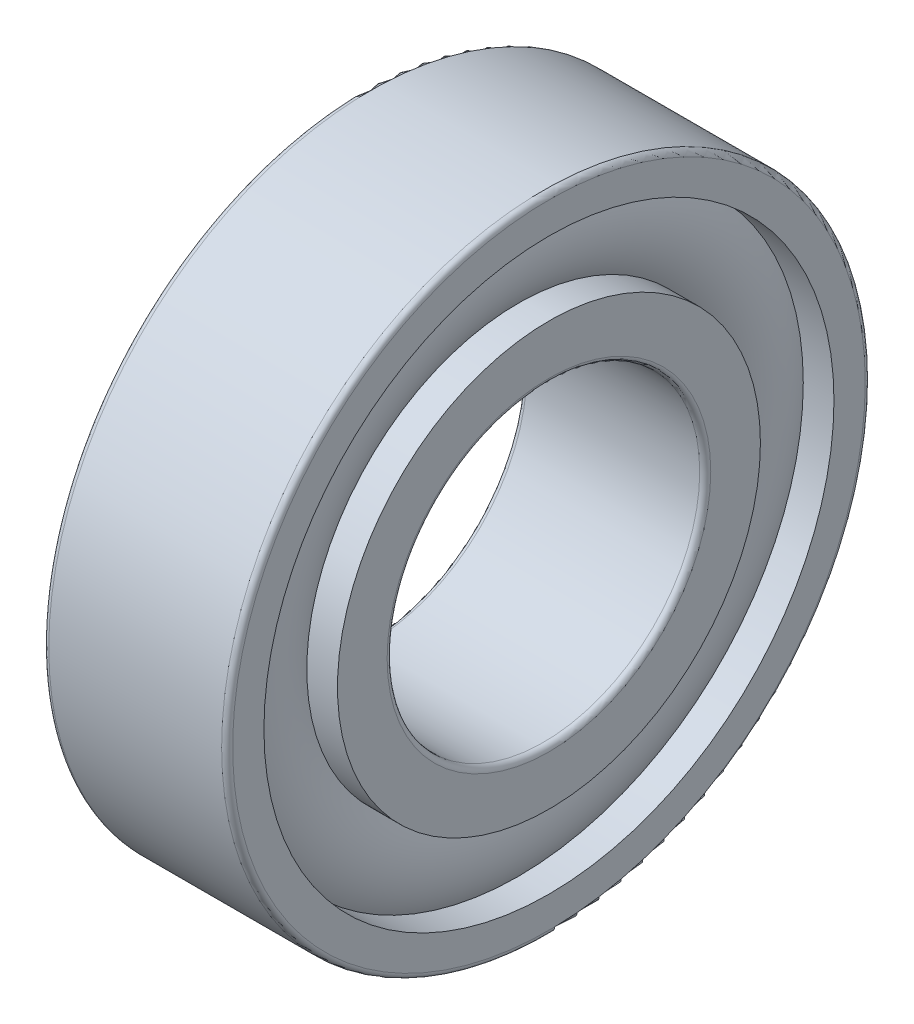
ISO-10303-21;
HEADER;
FILE_DESCRIPTION(('STEP AP214'),'2;1');
FILE_NAME('part.step','',(''),(''),'','','');
FILE_SCHEMA(('AUTOMOTIVE_DESIGN { 1 0 10303 214 1 1 1 1 }'));
ENDSEC;
DATA;
#1=APPLICATION_CONTEXT('core data for automotive mechanical design processes');
#2=APPLICATION_PROTOCOL_DEFINITION('international standard','automotive_design',2000,#1);
#3=PRODUCT_CONTEXT('',#1,'mechanical');
#4=PRODUCT('Part','Part','',(#3));
#5=PRODUCT_RELATED_PRODUCT_CATEGORY('part','',(#4));
#6=PRODUCT_DEFINITION_FORMATION('','',#4);
#7=PRODUCT_DEFINITION_CONTEXT('part definition',#1,'design');
#8=PRODUCT_DEFINITION('design','',#6,#7);
#9=PRODUCT_DEFINITION_SHAPE('','',#8);
#10=(LENGTH_UNIT() NAMED_UNIT(*) SI_UNIT(.MILLI.,.METRE.));
#11=(NAMED_UNIT(*) PLANE_ANGLE_UNIT() SI_UNIT($,.RADIAN.));
#12=(NAMED_UNIT(*) SI_UNIT($,.STERADIAN.) SOLID_ANGLE_UNIT());
#13=UNCERTAINTY_MEASURE_WITH_UNIT(LENGTH_MEASURE(1.E-05),#10,'distance_accuracy_value','');
#14=(GEOMETRIC_REPRESENTATION_CONTEXT(3) GLOBAL_UNCERTAINTY_ASSIGNED_CONTEXT((#13)) GLOBAL_UNIT_ASSIGNED_CONTEXT((#10,
#11,#12)) REPRESENTATION_CONTEXT('',''));
#15=CARTESIAN_POINT('',(0.,0.,0.));
#16=DIRECTION('',(0.,0.,1.));
#17=DIRECTION('',(1.,0.,0.));
#18=AXIS2_PLACEMENT_3D('',#15,#16,#17);
#19=CARTESIAN_POINT('',(14.7,0.,0.));
#20=DIRECTION('',(1.,0.,0.));
#21=DIRECTION('',(0.,0.,-1.));
#22=AXIS2_PLACEMENT_3D('',#19,#20,#21);
#23=CYLINDRICAL_SURFACE('',#22,11.5);
#24=CARTESIAN_POINT('',(10.9822270225271,0.,0.));
#25=DIRECTION('',(1.,0.,0.));
#26=DIRECTION('',(0.,0.,-1.));
#27=AXIS2_PLACEMENT_3D('',#24,#25,#26);
#28=CIRCLE('',#27,11.5);
#29=CARTESIAN_POINT('',(10.9822270225271,0.,-11.5));
#30=VERTEX_POINT('',#29);
#31=EDGE_CURVE('E10',#30,#30,#28,.T.);
#32=ORIENTED_EDGE('',*,*,#31,.T.);
#33=EDGE_LOOP('',(#32));
#34=FACE_BOUND('',#33,.T.);
#35=CARTESIAN_POINT('',(12.6509381598932,0.,0.));
#36=DIRECTION('',(1.,0.,0.));
#37=DIRECTION('',(0.,0.,-1.));
#38=AXIS2_PLACEMENT_3D('',#35,#36,#37);
#39=CIRCLE('',#38,11.5);
#40=CARTESIAN_POINT('',(12.6509381598932,0.,-11.5));
#41=VERTEX_POINT('',#40);
#42=EDGE_CURVE('E84',#41,#41,#39,.T.);
#43=ORIENTED_EDGE('',*,*,#42,.F.);
#44=EDGE_LOOP('',(#43));
#45=FACE_BOUND('',#44,.T.);
#46=ADVANCED_FACE('F32',(#34,#45),#23,.T.);
#47=CARTESIAN_POINT('',(7.6509381598932,0.,0.));
#48=DIRECTION('',(1.,0.,0.));
#49=DIRECTION('',(0.,0.,-1.));
#50=AXIS2_PLACEMENT_3D('',#47,#48,#49);
#51=TOROIDAL_SURFACE('',#50,13.5,3.88554828644667);
#52=CARTESIAN_POINT('',(10.9822270225271,0.,0.));
#53=DIRECTION('',(1.,0.,0.));
#54=DIRECTION('',(0.,0.,-1.));
#55=AXIS2_PLACEMENT_3D('',#52,#53,#54);
#56=CIRCLE('',#55,15.5);
#57=CARTESIAN_POINT('',(10.9822270225271,0.,-15.5));
#58=VERTEX_POINT('',#57);
#59=EDGE_CURVE('E38',#58,#58,#56,.T.);
#60=ORIENTED_EDGE('',*,*,#59,.T.);
#61=EDGE_LOOP('',(#60));
#62=FACE_BOUND('',#61,.T.);
#63=ORIENTED_EDGE('',*,*,#31,.F.);
#64=EDGE_LOOP('',(#63));
#65=FACE_BOUND('',#64,.T.);
#66=ADVANCED_FACE('F92',(#62,#65),#51,.T.);
#67=CARTESIAN_POINT('',(14.7,0.,0.));
#68=DIRECTION('',(1.,0.,0.));
#69=DIRECTION('',(0.,0.,-1.));
#70=AXIS2_PLACEMENT_3D('',#67,#68,#69);
#71=CYLINDRICAL_SURFACE('',#70,15.5);
#72=CARTESIAN_POINT('',(12.6509381598932,0.,0.));
#73=DIRECTION('',(1.,0.,0.));
#74=DIRECTION('',(0.,0.,-1.));
#75=AXIS2_PLACEMENT_3D('',#72,#73,#74);
#76=CIRCLE('',#75,15.5);
#77=CARTESIAN_POINT('',(12.6509381598932,0.,-15.5));
#78=VERTEX_POINT('',#77);
#79=EDGE_CURVE('E42',#78,#78,#76,.T.);
#80=ORIENTED_EDGE('',*,*,#79,.T.);
#81=EDGE_LOOP('',(#80));
#82=FACE_BOUND('',#81,.T.);
#83=ORIENTED_EDGE('',*,*,#59,.F.);
#84=EDGE_LOOP('',(#83));
#85=FACE_BOUND('',#84,.T.);
#86=ADVANCED_FACE('F96',(#82,#85),#71,.F.);
#87=CARTESIAN_POINT('',(12.6509381598932,15.5,0.));
#88=DIRECTION('',(1.,0.,0.));
#89=DIRECTION('',(0.,0.,-1.));
#90=AXIS2_PLACEMENT_3D('',#87,#88,#89);
#91=PLANE('',#90);
#92=CARTESIAN_POINT('',(12.6509381598932,0.,0.));
#93=DIRECTION('',(1.,0.,0.));
#94=DIRECTION('',(0.,0.,-1.));
#95=AXIS2_PLACEMENT_3D('',#92,#93,#94);
#96=CIRCLE('',#95,17.2);
#97=CARTESIAN_POINT('',(12.6509381598932,0.,-17.2));
#98=VERTEX_POINT('',#97);
#99=EDGE_CURVE('E46',#98,#98,#96,.T.);
#100=ORIENTED_EDGE('',*,*,#99,.T.);
#101=EDGE_LOOP('',(#100));
#102=FACE_BOUND('',#101,.T.);
#103=ORIENTED_EDGE('',*,*,#79,.F.);
#104=EDGE_LOOP('',(#103));
#105=FACE_BOUND('',#104,.T.);
#106=ADVANCED_FACE('F100',(#102,#105),#91,.T.);
#107=CARTESIAN_POINT('',(12.3509381598932,0.,0.));
#108=DIRECTION('',(1.,0.,0.));
#109=DIRECTION('',(0.,0.,-1.));
#110=AXIS2_PLACEMENT_3D('',#107,#108,#109);
#111=TOROIDAL_SURFACE('',#110,17.2,0.3);
#112=CARTESIAN_POINT('',(12.3509381598932,0.,0.));
#113=DIRECTION('',(1.,0.,0.));
#114=DIRECTION('',(0.,0.,-1.));
#115=AXIS2_PLACEMENT_3D('',#112,#113,#114);
#116=CIRCLE('',#115,17.5);
#117=CARTESIAN_POINT('',(12.3509381598932,0.,-17.5));
#118=VERTEX_POINT('',#117);
#119=EDGE_CURVE('E51',#118,#118,#116,.T.);
#120=ORIENTED_EDGE('',*,*,#119,.T.);
#121=EDGE_LOOP('',(#120));
#122=FACE_BOUND('',#121,.T.);
#123=ORIENTED_EDGE('',*,*,#99,.F.);
#124=EDGE_LOOP('',(#123));
#125=FACE_BOUND('',#124,.T.);
#126=ADVANCED_FACE('F107',(#122,#125),#111,.T.);
#127=CARTESIAN_POINT('',(14.7,0.,0.));
#128=DIRECTION('',(1.,0.,0.));
#129=DIRECTION('',(0.,0.,-1.));
#130=AXIS2_PLACEMENT_3D('',#127,#128,#129);
#131=CYLINDRICAL_SURFACE('',#130,17.5);
#132=CARTESIAN_POINT('',(2.9509381598932,0.,0.));
#133=DIRECTION('',(1.,0.,0.));
#134=DIRECTION('',(0.,0.,-1.));
#135=AXIS2_PLACEMENT_3D('',#132,#133,#134);
#136=CIRCLE('',#135,17.5);
#137=CARTESIAN_POINT('',(2.9509381598932,0.,-17.5));
#138=VERTEX_POINT('',#137);
#139=EDGE_CURVE('E54',#138,#138,#136,.T.);
#140=ORIENTED_EDGE('',*,*,#139,.T.);
#141=EDGE_LOOP('',(#140));
#142=FACE_BOUND('',#141,.T.);
#143=ORIENTED_EDGE('',*,*,#119,.F.);
#144=EDGE_LOOP('',(#143));
#145=FACE_BOUND('',#144,.T.);
#146=ADVANCED_FACE('F111',(#142,#145),#131,.T.);
#147=CARTESIAN_POINT('',(2.9509381598932,0.,0.));
#148=DIRECTION('',(1.,0.,0.));
#149=DIRECTION('',(0.,0.,-1.));
#150=AXIS2_PLACEMENT_3D('',#147,#148,#149);
#151=TOROIDAL_SURFACE('',#150,17.2,0.300000000000001);
#152=CARTESIAN_POINT('',(2.6509381598932,0.,0.));
#153=DIRECTION('',(1.,0.,0.));
#154=DIRECTION('',(0.,0.,-1.));
#155=AXIS2_PLACEMENT_3D('',#152,#153,#154);
#156=CIRCLE('',#155,17.2);
#157=CARTESIAN_POINT('',(2.6509381598932,0.,-17.2));
#158=VERTEX_POINT('',#157);
#159=EDGE_CURVE('E57',#158,#158,#156,.T.);
#160=ORIENTED_EDGE('',*,*,#159,.T.);
#161=EDGE_LOOP('',(#160));
#162=FACE_BOUND('',#161,.T.);
#163=ORIENTED_EDGE('',*,*,#139,.F.);
#164=EDGE_LOOP('',(#163));
#165=FACE_BOUND('',#164,.T.);
#166=ADVANCED_FACE('F115',(#162,#165),#151,.T.);
#167=CARTESIAN_POINT('',(2.6509381598932,17.2,0.));
#168=DIRECTION('',(-1.,0.,0.));
#169=DIRECTION('',(0.,0.,1.));
#170=AXIS2_PLACEMENT_3D('',#167,#168,#169);
#171=PLANE('',#170);
#172=CARTESIAN_POINT('',(2.6509381598932,0.,0.));
#173=DIRECTION('',(1.,0.,0.));
#174=DIRECTION('',(0.,0.,-1.));
#175=AXIS2_PLACEMENT_3D('',#172,#173,#174);
#176=CIRCLE('',#175,15.5);
#177=CARTESIAN_POINT('',(2.6509381598932,0.,-15.5));
#178=VERTEX_POINT('',#177);
#179=EDGE_CURVE('E60',#178,#178,#176,.T.);
#180=ORIENTED_EDGE('',*,*,#179,.T.);
#181=EDGE_LOOP('',(#180));
#182=FACE_BOUND('',#181,.T.);
#183=ORIENTED_EDGE('',*,*,#159,.F.);
#184=EDGE_LOOP('',(#183));
#185=FACE_BOUND('',#184,.T.);
#186=ADVANCED_FACE('F119',(#182,#185),#171,.T.);
#187=CARTESIAN_POINT('',(14.7,0.,0.));
#188=DIRECTION('',(1.,0.,0.));
#189=DIRECTION('',(0.,0.,-1.));
#190=AXIS2_PLACEMENT_3D('',#187,#188,#189);
#191=CYLINDRICAL_SURFACE('',#190,15.5);
#192=CARTESIAN_POINT('',(4.3196492972593,0.,0.));
#193=DIRECTION('',(1.,0.,0.));
#194=DIRECTION('',(0.,0.,-1.));
#195=AXIS2_PLACEMENT_3D('',#192,#193,#194);
#196=CIRCLE('',#195,15.5);
#197=CARTESIAN_POINT('',(4.3196492972593,0.,-15.5));
#198=VERTEX_POINT('',#197);
#199=EDGE_CURVE('E63',#198,#198,#196,.T.);
#200=ORIENTED_EDGE('',*,*,#199,.T.);
#201=EDGE_LOOP('',(#200));
#202=FACE_BOUND('',#201,.T.);
#203=ORIENTED_EDGE('',*,*,#179,.F.);
#204=EDGE_LOOP('',(#203));
#205=FACE_BOUND('',#204,.T.);
#206=ADVANCED_FACE('F123',(#202,#205),#191,.F.);
#207=CARTESIAN_POINT('',(7.6509381598932,0.,0.));
#208=DIRECTION('',(1.,0.,0.));
#209=DIRECTION('',(0.,0.,-1.));
#210=AXIS2_PLACEMENT_3D('',#207,#208,#209);
#211=TOROIDAL_SURFACE('',#210,13.5,3.88554828644667);
#212=CARTESIAN_POINT('',(4.3196492972593,0.,0.));
#213=DIRECTION('',(1.,0.,0.));
#214=DIRECTION('',(0.,0.,-1.));
#215=AXIS2_PLACEMENT_3D('',#212,#213,#214);
#216=CIRCLE('',#215,11.5);
#217=CARTESIAN_POINT('',(4.3196492972593,0.,-11.5));
#218=VERTEX_POINT('',#217);
#219=EDGE_CURVE('E66',#218,#218,#216,.T.);
#220=ORIENTED_EDGE('',*,*,#219,.T.);
#221=EDGE_LOOP('',(#220));
#222=FACE_BOUND('',#221,.T.);
#223=ORIENTED_EDGE('',*,*,#199,.F.);
#224=EDGE_LOOP('',(#223));
#225=FACE_BOUND('',#224,.T.);
#226=ADVANCED_FACE('F127',(#222,#225),#211,.T.);
#227=CARTESIAN_POINT('',(14.7,0.,0.));
#228=DIRECTION('',(1.,0.,0.));
#229=DIRECTION('',(0.,0.,-1.));
#230=AXIS2_PLACEMENT_3D('',#227,#228,#229);
#231=CYLINDRICAL_SURFACE('',#230,11.5);
#232=CARTESIAN_POINT('',(2.6509381598932,0.,0.));
#233=DIRECTION('',(1.,0.,0.));
#234=DIRECTION('',(0.,0.,-1.));
#235=AXIS2_PLACEMENT_3D('',#232,#233,#234);
#236=CIRCLE('',#235,11.5);
#237=CARTESIAN_POINT('',(2.6509381598932,0.,-11.5));
#238=VERTEX_POINT('',#237);
#239=EDGE_CURVE('E69',#238,#238,#236,.T.);
#240=ORIENTED_EDGE('',*,*,#239,.T.);
#241=EDGE_LOOP('',(#240));
#242=FACE_BOUND('',#241,.T.);
#243=ORIENTED_EDGE('',*,*,#219,.F.);
#244=EDGE_LOOP('',(#243));
#245=FACE_BOUND('',#244,.T.);
#246=ADVANCED_FACE('F131',(#242,#245),#231,.T.);
#247=CARTESIAN_POINT('',(2.6509381598932,8.8,0.));
#248=DIRECTION('',(-1.,0.,0.));
#249=DIRECTION('',(0.,0.,1.));
#250=AXIS2_PLACEMENT_3D('',#247,#248,#249);
#251=PLANE('',#250);
#252=CARTESIAN_POINT('',(2.6509381598932,0.,0.));
#253=DIRECTION('',(1.,0.,0.));
#254=DIRECTION('',(0.,0.,-1.));
#255=AXIS2_PLACEMENT_3D('',#252,#253,#254);
#256=CIRCLE('',#255,8.8);
#257=CARTESIAN_POINT('',(2.6509381598932,0.,-8.8));
#258=VERTEX_POINT('',#257);
#259=EDGE_CURVE('E72',#258,#258,#256,.T.);
#260=ORIENTED_EDGE('',*,*,#259,.T.);
#261=EDGE_LOOP('',(#260));
#262=FACE_BOUND('',#261,.T.);
#263=ORIENTED_EDGE('',*,*,#239,.F.);
#264=EDGE_LOOP('',(#263));
#265=FACE_BOUND('',#264,.T.);
#266=ADVANCED_FACE('F135',(#262,#265),#251,.T.);
#267=CARTESIAN_POINT('',(2.9509381598932,0.,0.));
#268=DIRECTION('',(1.,0.,0.));
#269=DIRECTION('',(0.,0.,-1.));
#270=AXIS2_PLACEMENT_3D('',#267,#268,#269);
#271=TOROIDAL_SURFACE('',#270,8.8,0.300000000000002);
#272=CARTESIAN_POINT('',(2.9509381598932,0.,0.));
#273=DIRECTION('',(1.,0.,0.));
#274=DIRECTION('',(0.,0.,-1.));
#275=AXIS2_PLACEMENT_3D('',#272,#273,#274);
#276=CIRCLE('',#275,8.5);
#277=CARTESIAN_POINT('',(2.9509381598932,0.,-8.5));
#278=VERTEX_POINT('',#277);
#279=EDGE_CURVE('E75',#278,#278,#276,.T.);
#280=ORIENTED_EDGE('',*,*,#279,.T.);
#281=EDGE_LOOP('',(#280));
#282=FACE_BOUND('',#281,.T.);
#283=ORIENTED_EDGE('',*,*,#259,.F.);
#284=EDGE_LOOP('',(#283));
#285=FACE_BOUND('',#284,.T.);
#286=ADVANCED_FACE('F139',(#282,#285),#271,.T.);
#287=CARTESIAN_POINT('',(14.7,0.,0.));
#288=DIRECTION('',(1.,0.,0.));
#289=DIRECTION('',(0.,0.,-1.));
#290=AXIS2_PLACEMENT_3D('',#287,#288,#289);
#291=CYLINDRICAL_SURFACE('',#290,8.5);
#292=CARTESIAN_POINT('',(12.3509381598932,0.,0.));
#293=DIRECTION('',(1.,0.,0.));
#294=DIRECTION('',(0.,0.,-1.));
#295=AXIS2_PLACEMENT_3D('',#292,#293,#294);
#296=CIRCLE('',#295,8.5);
#297=CARTESIAN_POINT('',(12.3509381598932,0.,-8.5));
#298=VERTEX_POINT('',#297);
#299=EDGE_CURVE('E78',#298,#298,#296,.T.);
#300=ORIENTED_EDGE('',*,*,#299,.T.);
#301=EDGE_LOOP('',(#300));
#302=FACE_BOUND('',#301,.T.);
#303=ORIENTED_EDGE('',*,*,#279,.F.);
#304=EDGE_LOOP('',(#303));
#305=FACE_BOUND('',#304,.T.);
#306=ADVANCED_FACE('F143',(#302,#305),#291,.F.);
#307=CARTESIAN_POINT('',(12.3509381598932,0.,0.));
#308=DIRECTION('',(1.,0.,0.));
#309=DIRECTION('',(0.,0.,-1.));
#310=AXIS2_PLACEMENT_3D('',#307,#308,#309);
#311=TOROIDAL_SURFACE('',#310,8.8,0.300000000000002);
#312=CARTESIAN_POINT('',(12.6509381598932,0.,0.));
#313=DIRECTION('',(1.,0.,0.));
#314=DIRECTION('',(0.,0.,-1.));
#315=AXIS2_PLACEMENT_3D('',#312,#313,#314);
#316=CIRCLE('',#315,8.8);
#317=CARTESIAN_POINT('',(12.6509381598932,0.,-8.8));
#318=VERTEX_POINT('',#317);
#319=EDGE_CURVE('E81',#318,#318,#316,.T.);
#320=ORIENTED_EDGE('',*,*,#319,.T.);
#321=EDGE_LOOP('',(#320));
#322=FACE_BOUND('',#321,.T.);
#323=ORIENTED_EDGE('',*,*,#299,.F.);
#324=EDGE_LOOP('',(#323));
#325=FACE_BOUND('',#324,.T.);
#326=ADVANCED_FACE('F147',(#322,#325),#311,.T.);
#327=CARTESIAN_POINT('',(12.6509381598932,8.8,0.));
#328=DIRECTION('',(1.,0.,0.));
#329=DIRECTION('',(0.,0.,-1.));
#330=AXIS2_PLACEMENT_3D('',#327,#328,#329);
#331=PLANE('',#330);
#332=ORIENTED_EDGE('',*,*,#42,.T.);
#333=EDGE_LOOP('',(#332));
#334=FACE_BOUND('',#333,.T.);
#335=ORIENTED_EDGE('',*,*,#319,.F.);
#336=EDGE_LOOP('',(#335));
#337=FACE_BOUND('',#336,.T.);
#338=ADVANCED_FACE('F88',(#334,#337),#331,.T.);
#339=CLOSED_SHELL('',(#46,#66,#86,#106,#126,#146,#166,#186,#206,#226,#246,#266,#286,#306,#326,#338));
#340=MANIFOLD_SOLID_BREP('B2',#339);
#341=ADVANCED_BREP_SHAPE_REPRESENTATION('',(#18,#340),#14);
#342=SHAPE_DEFINITION_REPRESENTATION(#9,#341);
ENDSEC;
END-ISO-10303-21;
